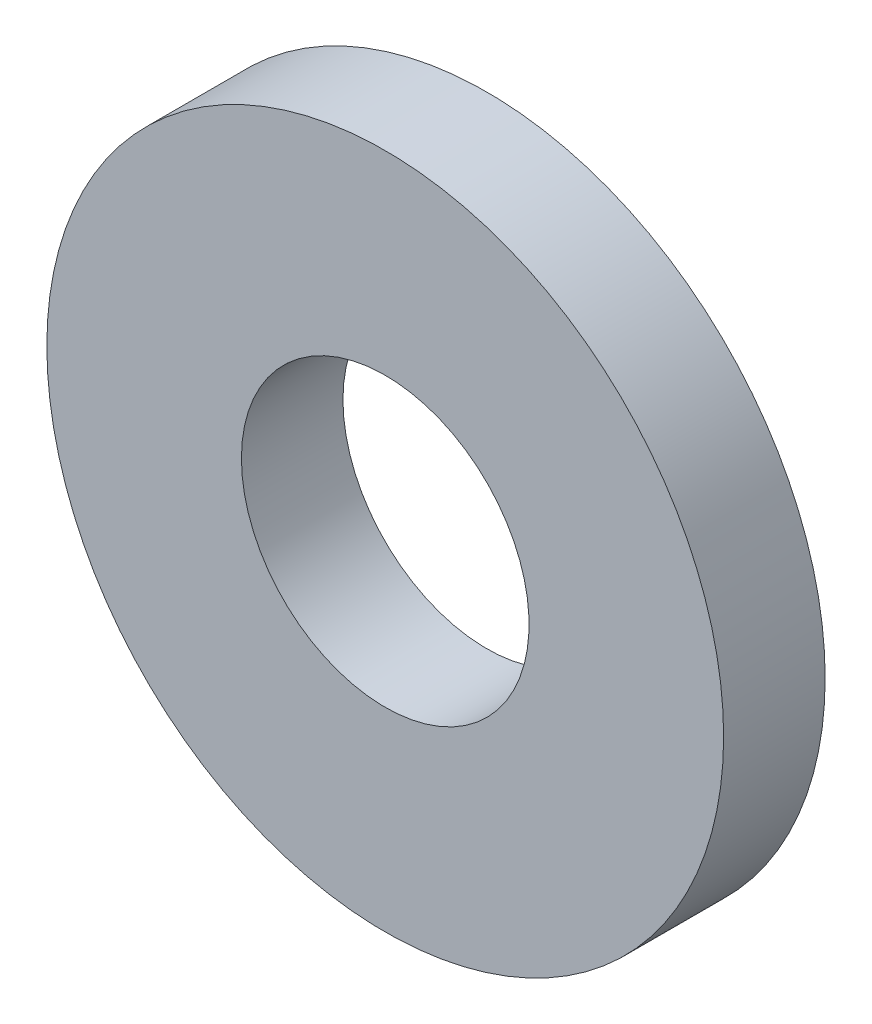
ISO-10303-21;
HEADER;
FILE_DESCRIPTION(('STEP AP214'),'2;1');
FILE_NAME('part.step','',(''),(''),'','','');
FILE_SCHEMA(('AUTOMOTIVE_DESIGN { 1 0 10303 214 1 1 1 1 }'));
ENDSEC;
DATA;
#1=APPLICATION_CONTEXT('core data for automotive mechanical design processes');
#2=APPLICATION_PROTOCOL_DEFINITION('international standard','automotive_design',2000,#1);
#3=PRODUCT_CONTEXT('',#1,'mechanical');
#4=PRODUCT('Part','Part','',(#3));
#5=PRODUCT_RELATED_PRODUCT_CATEGORY('part','',(#4));
#6=PRODUCT_DEFINITION_FORMATION('','',#4);
#7=PRODUCT_DEFINITION_CONTEXT('part definition',#1,'design');
#8=PRODUCT_DEFINITION('design','',#6,#7);
#9=PRODUCT_DEFINITION_SHAPE('','',#8);
#10=(LENGTH_UNIT() NAMED_UNIT(*) SI_UNIT(.MILLI.,.METRE.));
#11=(NAMED_UNIT(*) PLANE_ANGLE_UNIT() SI_UNIT($,.RADIAN.));
#12=(NAMED_UNIT(*) SI_UNIT($,.STERADIAN.) SOLID_ANGLE_UNIT());
#13=UNCERTAINTY_MEASURE_WITH_UNIT(LENGTH_MEASURE(1.E-05),#10,'distance_accuracy_value','');
#14=(GEOMETRIC_REPRESENTATION_CONTEXT(3) GLOBAL_UNCERTAINTY_ASSIGNED_CONTEXT((#13)) GLOBAL_UNIT_ASSIGNED_CONTEXT((#10,
#11,#12)) REPRESENTATION_CONTEXT('',''));
#15=CARTESIAN_POINT('',(0.,0.,0.));
#16=DIRECTION('',(0.,0.,1.));
#17=DIRECTION('',(1.,0.,0.));
#18=AXIS2_PLACEMENT_3D('',#15,#16,#17);
#19=CARTESIAN_POINT('',(349.999999999999,80.,0.));
#20=DIRECTION('',(0.,0.,1.));
#21=DIRECTION('',(1.,0.,0.));
#22=AXIS2_PLACEMENT_3D('',#19,#20,#21);
#23=PLANE('',#22);
#24=CARTESIAN_POINT('',(349.999999999999,80.,0.));
#25=DIRECTION('',(0.,0.,-1.));
#26=DIRECTION('',(-1.,0.,0.));
#27=AXIS2_PLACEMENT_3D('',#24,#25,#26);
#28=CIRCLE('',#27,8.50000000000001);
#29=CARTESIAN_POINT('',(341.499999999999,80.,0.));
#30=VERTEX_POINT('',#29);
#31=EDGE_CURVE('E26',#30,#30,#28,.F.);
#32=ORIENTED_EDGE('',*,*,#31,.T.);
#33=EDGE_LOOP('',(#32));
#34=FACE_BOUND('',#33,.T.);
#35=CARTESIAN_POINT('',(349.999999999999,80.,0.));
#36=DIRECTION('',(0.,0.,-1.));
#37=DIRECTION('',(-1.,0.,0.));
#38=AXIS2_PLACEMENT_3D('',#35,#36,#37);
#39=CIRCLE('',#38,20.);
#40=CARTESIAN_POINT('',(329.999999999999,80.,0.));
#41=VERTEX_POINT('',#40);
#42=EDGE_CURVE('E17',#41,#41,#39,.F.);
#43=ORIENTED_EDGE('',*,*,#42,.F.);
#44=EDGE_LOOP('',(#43));
#45=FACE_BOUND('',#44,.T.);
#46=ADVANCED_FACE('F14',(#34,#45),#23,.F.);
#47=CARTESIAN_POINT('',(349.999999999999,80.,6.00000000000001));
#48=DIRECTION('',(0.,0.,-1.));
#49=DIRECTION('',(-1.,0.,0.));
#50=AXIS2_PLACEMENT_3D('',#47,#48,#49);
#51=CYLINDRICAL_SURFACE('',#50,20.);
#52=ORIENTED_EDGE('',*,*,#42,.T.);
#53=EDGE_LOOP('',(#52));
#54=FACE_BOUND('',#53,.T.);
#55=CARTESIAN_POINT('',(349.999999999999,80.,6.00000000000001));
#56=DIRECTION('',(0.,0.,-1.));
#57=DIRECTION('',(-1.,0.,0.));
#58=AXIS2_PLACEMENT_3D('',#55,#56,#57);
#59=CIRCLE('',#58,20.);
#60=CARTESIAN_POINT('',(329.999999999999,80.,6.00000000000001));
#61=VERTEX_POINT('',#60);
#62=EDGE_CURVE('E21',#61,#61,#59,.F.);
#63=ORIENTED_EDGE('',*,*,#62,.F.);
#64=EDGE_LOOP('',(#63));
#65=FACE_BOUND('',#64,.T.);
#66=ADVANCED_FACE('F34',(#54,#65),#51,.T.);
#67=CARTESIAN_POINT('',(349.999999999999,80.,6.00000000000001));
#68=DIRECTION('',(0.,0.,-1.));
#69=DIRECTION('',(-1.,0.,0.));
#70=AXIS2_PLACEMENT_3D('',#67,#68,#69);
#71=CYLINDRICAL_SURFACE('',#70,8.50000000000001);
#72=CARTESIAN_POINT('',(349.999999999999,80.,6.00000000000001));
#73=DIRECTION('',(0.,0.,-1.));
#74=DIRECTION('',(-1.,0.,0.));
#75=AXIS2_PLACEMENT_3D('',#72,#73,#74);
#76=CIRCLE('',#75,8.50000000000001);
#77=CARTESIAN_POINT('',(341.499999999999,80.,6.00000000000001));
#78=VERTEX_POINT('',#77);
#79=EDGE_CURVE('E10',#78,#78,#76,.T.);
#80=ORIENTED_EDGE('',*,*,#79,.F.);
#81=EDGE_LOOP('',(#80));
#82=FACE_BOUND('',#81,.T.);
#83=ORIENTED_EDGE('',*,*,#31,.F.);
#84=EDGE_LOOP('',(#83));
#85=FACE_BOUND('',#84,.T.);
#86=ADVANCED_FACE('F42',(#82,#85),#71,.F.);
#87=CARTESIAN_POINT('',(349.999999999999,80.,6.00000000000001));
#88=DIRECTION('',(0.,0.,1.));
#89=DIRECTION('',(1.,0.,0.));
#90=AXIS2_PLACEMENT_3D('',#87,#88,#89);
#91=PLANE('',#90);
#92=ORIENTED_EDGE('',*,*,#79,.T.);
#93=EDGE_LOOP('',(#92));
#94=FACE_BOUND('',#93,.T.);
#95=ORIENTED_EDGE('',*,*,#62,.T.);
#96=EDGE_LOOP('',(#95));
#97=FACE_BOUND('',#96,.T.);
#98=ADVANCED_FACE('F43',(#94,#97),#91,.T.);
#99=CLOSED_SHELL('',(#46,#66,#86,#98));
#100=MANIFOLD_SOLID_BREP('B1',#99);
#101=ADVANCED_BREP_SHAPE_REPRESENTATION('',(#18,#100),#14);
#102=SHAPE_DEFINITION_REPRESENTATION(#9,#101);
ENDSEC;
END-ISO-10303-21;
